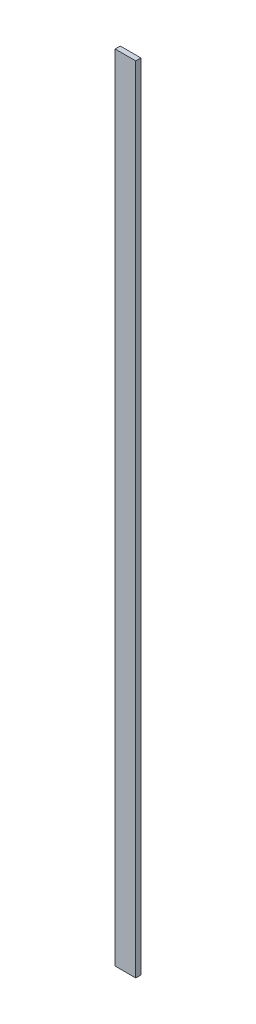
ISO-10303-21;
HEADER;
FILE_DESCRIPTION(('STEP AP214'),'2;1');
FILE_NAME('part.step','',(''),(''),'','','');
FILE_SCHEMA(('AUTOMOTIVE_DESIGN { 1 0 10303 214 1 1 1 1 }'));
ENDSEC;
DATA;
#1=APPLICATION_CONTEXT('core data for automotive mechanical design processes');
#2=APPLICATION_PROTOCOL_DEFINITION('international standard','automotive_design',2000,#1);
#3=PRODUCT_CONTEXT('',#1,'mechanical');
#4=PRODUCT('Part','Part','',(#3));
#5=PRODUCT_RELATED_PRODUCT_CATEGORY('part','',(#4));
#6=PRODUCT_DEFINITION_FORMATION('','',#4);
#7=PRODUCT_DEFINITION_CONTEXT('part definition',#1,'design');
#8=PRODUCT_DEFINITION('design','',#6,#7);
#9=PRODUCT_DEFINITION_SHAPE('','',#8);
#10=(LENGTH_UNIT() NAMED_UNIT(*) SI_UNIT(.MILLI.,.METRE.));
#11=(NAMED_UNIT(*) PLANE_ANGLE_UNIT() SI_UNIT($,.RADIAN.));
#12=(NAMED_UNIT(*) SI_UNIT($,.STERADIAN.) SOLID_ANGLE_UNIT());
#13=UNCERTAINTY_MEASURE_WITH_UNIT(LENGTH_MEASURE(1.E-05),#10,'distance_accuracy_value','');
#14=(GEOMETRIC_REPRESENTATION_CONTEXT(3) GLOBAL_UNCERTAINTY_ASSIGNED_CONTEXT((#13)) GLOBAL_UNIT_ASSIGNED_CONTEXT((#10,
#11,#12)) REPRESENTATION_CONTEXT('',''));
#15=CARTESIAN_POINT('',(0.,0.,0.));
#16=DIRECTION('',(0.,0.,1.));
#17=DIRECTION('',(1.,0.,0.));
#18=AXIS2_PLACEMENT_3D('',#15,#16,#17);
#19=CARTESIAN_POINT('',(0.,0.,0.5));
#20=DIRECTION('',(1.,0.,0.));
#21=DIRECTION('',(0.,1.,0.));
#22=AXIS2_PLACEMENT_3D('',#19,#20,#21);
#23=PLANE('',#22);
#24=DIRECTION('',(0.,-1.,0.));
#25=VECTOR('',#24,1.);
#26=CARTESIAN_POINT('',(0.,0.,0.));
#27=LINE('',#26,#25);
#28=CARTESIAN_POINT('',(0.,0.,0.));
#29=VERTEX_POINT('',#28);
#30=CARTESIAN_POINT('',(0.,-77.,0.));
#31=VERTEX_POINT('',#30);
#32=EDGE_CURVE('E94',#29,#31,#27,.T.);
#33=ORIENTED_EDGE('',*,*,#32,.T.);
#34=DIRECTION('',(0.,0.,-1.));
#35=VECTOR('',#34,1.);
#36=CARTESIAN_POINT('',(0.,-77.,0.5));
#37=LINE('',#36,#35);
#38=CARTESIAN_POINT('',(0.,-77.,0.5));
#39=VERTEX_POINT('',#38);
#40=EDGE_CURVE('E11',#39,#31,#37,.T.);
#41=ORIENTED_EDGE('',*,*,#40,.F.);
#42=DIRECTION('',(0.,-1.,0.));
#43=VECTOR('',#42,1.);
#44=CARTESIAN_POINT('',(0.,0.,0.5));
#45=LINE('',#44,#43);
#46=CARTESIAN_POINT('',(0.,0.,0.5));
#47=VERTEX_POINT('',#46);
#48=EDGE_CURVE('E82',#47,#39,#45,.T.);
#49=ORIENTED_EDGE('',*,*,#48,.F.);
#50=DIRECTION('',(0.,0.,-1.));
#51=VECTOR('',#50,1.);
#52=CARTESIAN_POINT('',(0.,0.,0.5));
#53=LINE('',#52,#51);
#54=EDGE_CURVE('E90',#47,#29,#53,.T.);
#55=ORIENTED_EDGE('',*,*,#54,.T.);
#56=EDGE_LOOP('',(#33,#41,#49,#55));
#57=FACE_BOUND('',#56,.T.);
#58=ADVANCED_FACE('F31',(#57),#23,.F.);
#59=CARTESIAN_POINT('',(0.,-77.,0.5));
#60=DIRECTION('',(0.,1.,0.));
#61=DIRECTION('',(0.,0.,1.));
#62=AXIS2_PLACEMENT_3D('',#59,#60,#61);
#63=PLANE('',#62);
#64=DIRECTION('',(1.,0.,0.));
#65=VECTOR('',#64,1.);
#66=CARTESIAN_POINT('',(0.,-77.,0.));
#67=LINE('',#66,#65);
#68=CARTESIAN_POINT('',(2.00000000000001,-77.,0.));
#69=VERTEX_POINT('',#68);
#70=EDGE_CURVE('E86',#31,#69,#67,.T.);
#71=ORIENTED_EDGE('',*,*,#70,.T.);
#72=DIRECTION('',(0.,0.,-1.));
#73=VECTOR('',#72,1.);
#74=CARTESIAN_POINT('',(2.00000000000001,-77.,0.5));
#75=LINE('',#74,#73);
#76=CARTESIAN_POINT('',(2.00000000000001,-77.,0.5));
#77=VERTEX_POINT('',#76);
#78=EDGE_CURVE('E39',#77,#69,#75,.T.);
#79=ORIENTED_EDGE('',*,*,#78,.F.);
#80=DIRECTION('',(1.,0.,0.));
#81=VECTOR('',#80,1.);
#82=CARTESIAN_POINT('',(0.,-77.,0.5));
#83=LINE('',#82,#81);
#84=EDGE_CURVE('E77',#39,#77,#83,.T.);
#85=ORIENTED_EDGE('',*,*,#84,.F.);
#86=ORIENTED_EDGE('',*,*,#40,.T.);
#87=EDGE_LOOP('',(#71,#79,#85,#86));
#88=FACE_BOUND('',#87,.T.);
#89=ADVANCED_FACE('F85',(#88),#63,.F.);
#90=CARTESIAN_POINT('',(2.,0.,0.5));
#91=DIRECTION('',(-1.,0.,0.));
#92=DIRECTION('',(0.,-1.,0.));
#93=AXIS2_PLACEMENT_3D('',#90,#91,#92);
#94=PLANE('',#93);
#95=DIRECTION('',(0.,1.,0.));
#96=VECTOR('',#95,1.);
#97=CARTESIAN_POINT('',(2.,0.,0.));
#98=LINE('',#97,#96);
#99=CARTESIAN_POINT('',(2.,0.,0.));
#100=VERTEX_POINT('',#99);
#101=EDGE_CURVE('E64',#69,#100,#98,.T.);
#102=ORIENTED_EDGE('',*,*,#101,.T.);
#103=DIRECTION('',(0.,0.,-1.));
#104=VECTOR('',#103,1.);
#105=CARTESIAN_POINT('',(2.,0.,0.5));
#106=LINE('',#105,#104);
#107=CARTESIAN_POINT('',(2.,0.,0.5));
#108=VERTEX_POINT('',#107);
#109=EDGE_CURVE('E87',#108,#100,#106,.T.);
#110=ORIENTED_EDGE('',*,*,#109,.F.);
#111=DIRECTION('',(0.,1.,0.));
#112=VECTOR('',#111,1.);
#113=CARTESIAN_POINT('',(2.,0.,0.5));
#114=LINE('',#113,#112);
#115=EDGE_CURVE('E80',#77,#108,#114,.T.);
#116=ORIENTED_EDGE('',*,*,#115,.F.);
#117=ORIENTED_EDGE('',*,*,#78,.T.);
#118=EDGE_LOOP('',(#102,#110,#116,#117));
#119=FACE_BOUND('',#118,.T.);
#120=ADVANCED_FACE('F88',(#119),#94,.F.);
#121=CARTESIAN_POINT('',(0.,0.,0.5));
#122=DIRECTION('',(0.,-1.,0.));
#123=DIRECTION('',(0.,0.,-1.));
#124=AXIS2_PLACEMENT_3D('',#121,#122,#123);
#125=PLANE('',#124);
#126=DIRECTION('',(-1.,0.,0.));
#127=VECTOR('',#126,1.);
#128=CARTESIAN_POINT('',(0.,0.,0.));
#129=LINE('',#128,#127);
#130=EDGE_CURVE('E70',#100,#29,#129,.T.);
#131=ORIENTED_EDGE('',*,*,#130,.T.);
#132=ORIENTED_EDGE('',*,*,#54,.F.);
#133=DIRECTION('',(-1.,0.,0.));
#134=VECTOR('',#133,1.);
#135=CARTESIAN_POINT('',(0.,0.,0.5));
#136=LINE('',#135,#134);
#137=EDGE_CURVE('E47',#108,#47,#136,.T.);
#138=ORIENTED_EDGE('',*,*,#137,.F.);
#139=ORIENTED_EDGE('',*,*,#109,.T.);
#140=EDGE_LOOP('',(#131,#132,#138,#139));
#141=FACE_BOUND('',#140,.T.);
#142=ADVANCED_FACE('F101',(#141),#125,.F.);
#143=CARTESIAN_POINT('',(0.,-77.,0.5));
#144=DIRECTION('',(0.,0.,1.));
#145=DIRECTION('',(1.,0.,0.));
#146=AXIS2_PLACEMENT_3D('',#143,#144,#145);
#147=PLANE('',#146);
#148=ORIENTED_EDGE('',*,*,#48,.T.);
#149=ORIENTED_EDGE('',*,*,#84,.T.);
#150=ORIENTED_EDGE('',*,*,#115,.T.);
#151=ORIENTED_EDGE('',*,*,#137,.T.);
#152=EDGE_LOOP('',(#148,#149,#150,#151));
#153=FACE_BOUND('',#152,.T.);
#154=ADVANCED_FACE('F78',(#153),#147,.T.);
#155=CARTESIAN_POINT('',(0.,-77.,0.));
#156=DIRECTION('',(0.,0.,1.));
#157=DIRECTION('',(1.,0.,0.));
#158=AXIS2_PLACEMENT_3D('',#155,#156,#157);
#159=PLANE('',#158);
#160=ORIENTED_EDGE('',*,*,#32,.F.);
#161=ORIENTED_EDGE('',*,*,#130,.F.);
#162=ORIENTED_EDGE('',*,*,#101,.F.);
#163=ORIENTED_EDGE('',*,*,#70,.F.);
#164=EDGE_LOOP('',(#160,#161,#162,#163));
#165=FACE_BOUND('',#164,.T.);
#166=ADVANCED_FACE('F104',(#165),#159,.F.);
#167=CLOSED_SHELL('',(#58,#89,#120,#142,#154,#166));
#168=MANIFOLD_SOLID_BREP('B2',#167);
#169=ADVANCED_BREP_SHAPE_REPRESENTATION('',(#18,#168),#14);
#170=SHAPE_DEFINITION_REPRESENTATION(#9,#169);
ENDSEC;
END-ISO-10303-21;
